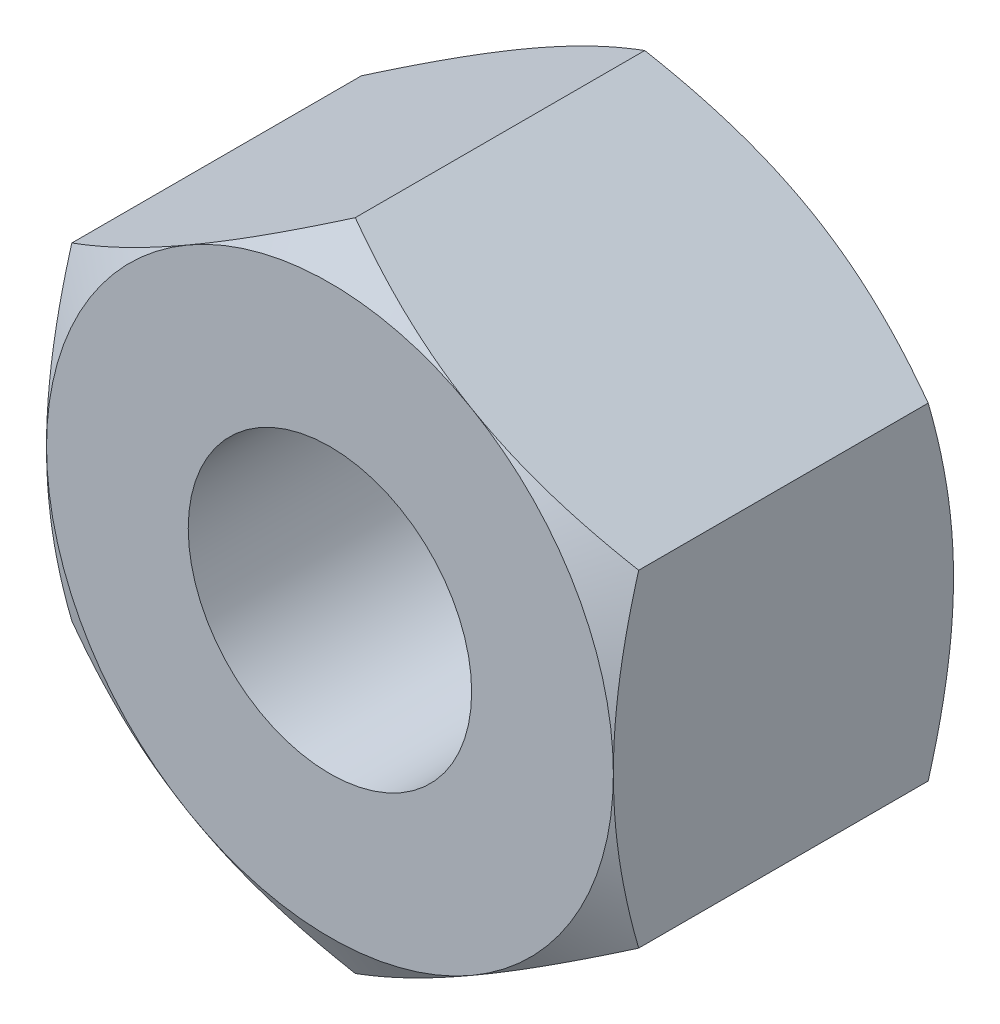
ISO-10303-21;
HEADER;
FILE_DESCRIPTION(('STEP AP214'),'2;1');
FILE_NAME('part.step','',(''),(''),'','','');
FILE_SCHEMA(('AUTOMOTIVE_DESIGN { 1 0 10303 214 1 1 1 1 }'));
ENDSEC;
DATA;
#1=APPLICATION_CONTEXT('core data for automotive mechanical design processes');
#2=APPLICATION_PROTOCOL_DEFINITION('international standard','automotive_design',2000,#1);
#3=PRODUCT_CONTEXT('',#1,'mechanical');
#4=PRODUCT('Part','Part','',(#3));
#5=PRODUCT_RELATED_PRODUCT_CATEGORY('part','',(#4));
#6=PRODUCT_DEFINITION_FORMATION('','',#4);
#7=PRODUCT_DEFINITION_CONTEXT('part definition',#1,'design');
#8=PRODUCT_DEFINITION('design','',#6,#7);
#9=PRODUCT_DEFINITION_SHAPE('','',#8);
#10=(LENGTH_UNIT() NAMED_UNIT(*) SI_UNIT(.MILLI.,.METRE.));
#11=(NAMED_UNIT(*) PLANE_ANGLE_UNIT() SI_UNIT($,.RADIAN.));
#12=(NAMED_UNIT(*) SI_UNIT($,.STERADIAN.) SOLID_ANGLE_UNIT());
#13=UNCERTAINTY_MEASURE_WITH_UNIT(LENGTH_MEASURE(1.E-05),#10,'distance_accuracy_value','');
#14=(GEOMETRIC_REPRESENTATION_CONTEXT(3) GLOBAL_UNCERTAINTY_ASSIGNED_CONTEXT((#13)) GLOBAL_UNIT_ASSIGNED_CONTEXT((#10,
#11,#12)) REPRESENTATION_CONTEXT('',''));
#15=CARTESIAN_POINT('',(0.,0.,0.));
#16=DIRECTION('',(0.,0.,1.));
#17=DIRECTION('',(1.,0.,0.));
#18=AXIS2_PLACEMENT_3D('',#15,#16,#17);
#19=CARTESIAN_POINT('',(0.,0.,6.));
#20=DIRECTION('',(0.,0.,1.));
#21=DIRECTION('',(1.,0.,0.));
#22=AXIS2_PLACEMENT_3D('',#19,#20,#21);
#23=PLANE('',#22);
#24=CARTESIAN_POINT('',(0.,0.,6.));
#25=DIRECTION('',(0.,0.,1.));
#26=DIRECTION('',(1.,0.,0.));
#27=AXIS2_PLACEMENT_3D('',#24,#25,#26);
#28=CIRCLE('',#27,4.99999999999998);
#29=CARTESIAN_POINT('',(5.,0.,6.));
#30=VERTEX_POINT('',#29);
#31=CARTESIAN_POINT('',(2.50000000000001,-4.33012701892219,6.));
#32=VERTEX_POINT('',#31);
#33=EDGE_CURVE('E11',#30,#32,#28,.F.);
#34=ORIENTED_EDGE('',*,*,#33,.F.);
#35=CARTESIAN_POINT('',(2.50000000000001,4.33012701892219,6.));
#36=VERTEX_POINT('',#35);
#37=EDGE_CURVE('E38',#36,#30,#28,.F.);
#38=ORIENTED_EDGE('',*,*,#37,.F.);
#39=CARTESIAN_POINT('',(-2.49999999999999,4.3301270189222,6.));
#40=VERTEX_POINT('',#39);
#41=EDGE_CURVE('E277',#40,#36,#28,.F.);
#42=ORIENTED_EDGE('',*,*,#41,.F.);
#43=CARTESIAN_POINT('',(-5.,0.,6.));
#44=VERTEX_POINT('',#43);
#45=EDGE_CURVE('E281',#44,#40,#28,.F.);
#46=ORIENTED_EDGE('',*,*,#45,.F.);
#47=CARTESIAN_POINT('',(-2.49999999999999,-4.3301270189222,6.));
#48=VERTEX_POINT('',#47);
#49=EDGE_CURVE('E305',#48,#44,#28,.F.);
#50=ORIENTED_EDGE('',*,*,#49,.F.);
#51=EDGE_CURVE('E43',#32,#48,#28,.F.);
#52=ORIENTED_EDGE('',*,*,#51,.F.);
#53=EDGE_LOOP('',(#34,#38,#42,#46,#50,#52));
#54=FACE_BOUND('',#53,.T.);
#55=CARTESIAN_POINT('',(0.,0.,6.));
#56=DIRECTION('',(0.,0.,1.));
#57=DIRECTION('',(1.,0.,0.));
#58=AXIS2_PLACEMENT_3D('',#55,#56,#57);
#59=CIRCLE('',#58,2.5);
#60=CARTESIAN_POINT('',(2.5,0.,6.));
#61=VERTEX_POINT('',#60);
#62=EDGE_CURVE('E248',#61,#61,#59,.T.);
#63=ORIENTED_EDGE('',*,*,#62,.F.);
#64=EDGE_LOOP('',(#63));
#65=FACE_BOUND('',#64,.T.);
#66=ADVANCED_FACE('F33',(#54,#65),#23,.T.);
#67=CARTESIAN_POINT('',(0.,0.,0.));
#68=DIRECTION('',(0.,0.,1.));
#69=DIRECTION('',(1.,0.,0.));
#70=AXIS2_PLACEMENT_3D('',#67,#68,#69);
#71=PLANE('',#70);
#72=CARTESIAN_POINT('',(0.,0.,0.));
#73=DIRECTION('',(0.,0.,1.));
#74=DIRECTION('',(1.,0.,0.));
#75=AXIS2_PLACEMENT_3D('',#72,#73,#74);
#76=CIRCLE('',#75,2.5);
#77=CARTESIAN_POINT('',(2.5,0.,0.));
#78=VERTEX_POINT('',#77);
#79=EDGE_CURVE('E251',#78,#78,#76,.F.);
#80=ORIENTED_EDGE('',*,*,#79,.F.);
#81=EDGE_LOOP('',(#80));
#82=FACE_BOUND('',#81,.T.);
#83=CARTESIAN_POINT('',(0.,0.,0.));
#84=DIRECTION('',(0.,0.,1.));
#85=DIRECTION('',(1.,0.,0.));
#86=AXIS2_PLACEMENT_3D('',#83,#84,#85);
#87=CIRCLE('',#86,4.99999999999999);
#88=CARTESIAN_POINT('',(2.5,4.3301270189222,0.));
#89=VERTEX_POINT('',#88);
#90=CARTESIAN_POINT('',(5.,0.,0.));
#91=VERTEX_POINT('',#90);
#92=EDGE_CURVE('E142',#89,#91,#87,.F.);
#93=ORIENTED_EDGE('',*,*,#92,.T.);
#94=CARTESIAN_POINT('',(2.5,-4.33012701892219,0.));
#95=VERTEX_POINT('',#94);
#96=EDGE_CURVE('E150',#91,#95,#87,.F.);
#97=ORIENTED_EDGE('',*,*,#96,.T.);
#98=CARTESIAN_POINT('',(-2.5,-4.3301270189222,0.));
#99=VERTEX_POINT('',#98);
#100=EDGE_CURVE('E288',#95,#99,#87,.F.);
#101=ORIENTED_EDGE('',*,*,#100,.T.);
#102=CARTESIAN_POINT('',(-5.,0.,0.));
#103=VERTEX_POINT('',#102);
#104=EDGE_CURVE('E291',#99,#103,#87,.F.);
#105=ORIENTED_EDGE('',*,*,#104,.T.);
#106=CARTESIAN_POINT('',(-2.5,4.3301270189222,0.));
#107=VERTEX_POINT('',#106);
#108=EDGE_CURVE('E154',#103,#107,#87,.F.);
#109=ORIENTED_EDGE('',*,*,#108,.T.);
#110=EDGE_CURVE('E128',#107,#89,#87,.F.);
#111=ORIENTED_EDGE('',*,*,#110,.T.);
#112=EDGE_LOOP('',(#93,#97,#101,#105,#109,#111));
#113=FACE_BOUND('',#112,.T.);
#114=ADVANCED_FACE('F151',(#82,#113),#71,.F.);
#115=CARTESIAN_POINT('',(0.,0.,-0.00100000000000013));
#116=DIRECTION('',(0.,0.,1.));
#117=DIRECTION('',(1.,0.,0.));
#118=AXIS2_PLACEMENT_3D('',#115,#116,#117);
#119=CYLINDRICAL_SURFACE('',#118,2.5);
#120=ORIENTED_EDGE('',*,*,#62,.T.);
#121=EDGE_LOOP('',(#120));
#122=FACE_BOUND('',#121,.T.);
#123=ORIENTED_EDGE('',*,*,#79,.T.);
#124=EDGE_LOOP('',(#123));
#125=FACE_BOUND('',#124,.T.);
#126=ADVANCED_FACE('F333',(#122,#125),#119,.F.);
#127=CARTESIAN_POINT('',(0.,0.,2.99999999999999));
#128=DIRECTION('',(0.,0.,1.));
#129=DIRECTION('',(1.,0.,0.));
#130=AXIS2_PLACEMENT_3D('',#127,#128,#129);
#131=CONICAL_SURFACE('',#130,10.1961524227067,1.0471975511966);
#132=CARTESIAN_POINT('',(5.,-7.80316883937987,2.46393222209149));
#133=CARTESIAN_POINT('',(5.,-7.58434008152841,2.35758454985764));
#134=CARTESIAN_POINT('',(5.,-7.36501415769005,2.25224261642255));
#135=CARTESIAN_POINT('',(5.,-6.92510371666718,2.0441350083384));
#136=CARTESIAN_POINT('',(5.,-6.70451901196256,1.94136973051889));
#137=CARTESIAN_POINT('',(5.,-6.26071393844021,1.7384738184123));
#138=CARTESIAN_POINT('',(5.,-6.03748578801693,1.63836014733487));
#139=CARTESIAN_POINT('',(5.,-5.58927072437996,1.44216575416831));
#140=CARTESIAN_POINT('',(5.,-5.36428389349422,1.34608484462149));
#141=CARTESIAN_POINT('',(5.,-4.90480770728734,1.15596309400265));
#142=CARTESIAN_POINT('',(5.,-4.67024799294134,1.0620913774718));
#143=CARTESIAN_POINT('',(5.,-4.19840267359291,0.881334608140105));
#144=CARTESIAN_POINT('',(5.,-3.96111676881602,0.794450332252961));
#145=CARTESIAN_POINT('',(5.,-3.48386980198859,0.629912976700726));
#146=CARTESIAN_POINT('',(5.,-3.24391509638985,0.552241642646051));
#147=CARTESIAN_POINT('',(5.,-2.76056410759437,0.408589844158487));
#148=CARTESIAN_POINT('',(5.,-2.51716891822013,0.342605750459397));
#149=CARTESIAN_POINT('',(5.,-2.028127397285,0.225808102083455));
#150=CARTESIAN_POINT('',(5.,-1.78250104631849,0.174912413783899));
#151=CARTESIAN_POINT('',(5.,-1.28814345079875,0.0911449660364333));
#152=CARTESIAN_POINT('',(5.,-1.0394125275845,0.0582713567773772));
#153=CARTESIAN_POINT('',(5.,-0.543358368598705,0.0135987921851739));
#154=CARTESIAN_POINT('',(5.,-0.296060514309956,0.00152494939433517));
#155=CARTESIAN_POINT('',(5.,0.198679022003401,-0.00125120072037702));
#156=CARTESIAN_POINT('',(5.,0.446120707025886,0.0080469546423193));
#157=CARTESIAN_POINT('',(5.,0.864703740300243,0.0411910660329488));
#158=CARTESIAN_POINT('',(5.,1.03628722721722,0.0597865031114803));
#159=CARTESIAN_POINT('',(5.,1.37822308981919,0.106123235961369));
#160=CARTESIAN_POINT('',(5.,1.54857530116503,0.133865730373892));
#161=CARTESIAN_POINT('',(5.,2.05753955809973,0.229358194565206));
#162=CARTESIAN_POINT('',(5.,2.3938804141877,0.309357082888703));
#163=CARTESIAN_POINT('',(5.,2.89698014317449,0.448420954505136));
#164=CARTESIAN_POINT('',(5.,3.0663359791463,0.498628291817747));
#165=CARTESIAN_POINT('',(5.,3.40340262437593,0.604338982714489));
#166=CARTESIAN_POINT('',(5.,3.57111342157756,0.659842375080534));
#167=CARTESIAN_POINT('',(5.,3.90494322885525,0.775247559189704));
#168=CARTESIAN_POINT('',(5.,4.07106271100704,0.835147997763797));
#169=CARTESIAN_POINT('',(5.,4.40191818306855,0.958634275436366));
#170=CARTESIAN_POINT('',(5.,4.56665419958039,1.02222004348448));
#171=CARTESIAN_POINT('',(5.,4.99446476329977,1.19196983848214));
#172=CARTESIAN_POINT('',(5.,5.25657381683109,1.30056432093056));
#173=CARTESIAN_POINT('',(5.,5.77823779687665,1.52374409151217));
#174=CARTESIAN_POINT('',(5.,6.03779248157002,1.63832994048436));
#175=CARTESIAN_POINT('',(5.,6.55489643575948,1.87212870196661));
#176=CARTESIAN_POINT('',(5.,6.81244508206398,1.991342988501));
#177=CARTESIAN_POINT('',(5.,7.32585971512802,2.23334853220542));
#178=CARTESIAN_POINT('',(5.,7.58172565531362,2.35613988787512));
#179=CARTESIAN_POINT('',(5.,8.09244052517889,2.60471791070782));
#180=CARTESIAN_POINT('',(5.,8.34728752036519,2.73050854466553));
#181=CARTESIAN_POINT('',(5.,8.85585005557578,2.98435886044892));
#182=CARTESIAN_POINT('',(5.,9.10956558421784,3.11241856503665));
#183=CARTESIAN_POINT('',(5.,9.86922079099677,3.49928186996426));
#184=CARTESIAN_POINT('',(5.,10.3737681995536,3.76081835051602));
#185=CARTESIAN_POINT('',(5.,11.330233530429,4.26257697560308));
#186=CARTESIAN_POINT('',(5.,11.7823970110435,4.50233323843819));
#187=CARTESIAN_POINT('',(5.,12.6851700825874,4.98480887341031));
#188=CARTESIAN_POINT('',(5.,13.135779590258,5.22752840124455));
#189=CARTESIAN_POINT('',(5.,14.0344206427673,5.71442862583434));
#190=CARTESIAN_POINT('',(5.,14.4824558558712,5.95860256292541));
#191=CARTESIAN_POINT('',(5.,15.3775525995183,6.44865476665978));
#192=CARTESIAN_POINT('',(5.,15.8246141964279,6.69453291203248));
#193=CARTESIAN_POINT('',(5.,16.2713292734523,6.94103504986347));
#194=B_SPLINE_CURVE_WITH_KNOTS('',3,(#132,#133,#134,#135,#136,#137,#138,#139,#140,#141,#142,
#143,#144,#145,#146,#147,#148,#149,#150,#151,#152,#153,#154,#155,#156,#157,#158,#159,#160,#161,
#162,#163,#164,#165,#166,#167,#168,#169,#170,#171,#172,#173,#174,#175,#176,#177,#178,#179,#180,
#181,#182,#183,#184,#185,#186,#187,#188,#189,#190,#191,#192,#193),.UNSPECIFIED.,.F.,.F.,(4,2,2,
2,2,2,2,2,2,2,2,2,2,2,2,2,2,2,2,2,2,2,2,2,2,2,2,2,2,2,4),(0.,0.729914624496415,1.45994098077917,
2.19385859499905,2.92774205614457,3.68559492267544,4.44353193655166,5.19994116977278,
5.95611510006769,6.7080938568636,7.45999541506101,8.20188143671202,8.94378351974995,
9.46129810648509,9.97888053591174,11.0145815411683,11.5444594716677,12.0743412826513,
12.6040607033286,13.1337699148117,13.9848048836638,14.835919659198,15.687289063013,
16.5386819326889,17.3912712584004,18.2438691416619,19.9487336739832,21.4841095502972,
23.0195664492263,24.5503166417643,26.0809590029062),.UNSPECIFIED.);
#195=CARTESIAN_POINT('',(5.,2.88675134594813,0.446581987385198));
#196=VERTEX_POINT('',#195);
#197=EDGE_CURVE('E145',#91,#196,#194,.T.);
#198=ORIENTED_EDGE('',*,*,#197,.F.);
#199=ORIENTED_EDGE('',*,*,#92,.F.);
#200=CARTESIAN_POINT('',(5.0002,2.88663587589429,0.446648656051826));
#201=CARTESIAN_POINT('',(4.78046540547481,3.01349970319368,0.373386567637633));
#202=CARTESIAN_POINT('',(4.55885141554042,3.14144859993849,0.306751321918091));
#203=CARTESIAN_POINT('',(4.11178600454648,3.39956193532121,0.190438991010811));
#204=CARTESIAN_POINT('',(3.88632664040922,3.52973095989718,0.14080304991579));
#205=CARTESIAN_POINT('',(3.43816769477649,3.78847564779798,0.0635510254187004));
#206=CARTESIAN_POINT('',(3.21553790689581,3.91701101576052,0.035420378283492));
#207=CARTESIAN_POINT('',(2.88081009815336,4.11026620624323,0.0101949219536879));
#208=CARTESIAN_POINT('',(2.76915780319494,4.17472868879311,0.00461345976948772));
#209=CARTESIAN_POINT('',(2.5457500293262,4.30371322717528,-0.000797783248525579));
#210=CARTESIAN_POINT('',(2.43399455370968,4.36823528110589,-0.000627741741792326));
#211=CARTESIAN_POINT('',(2.12781576914936,4.54500768479195,0.00775363179204104));
#212=CARTESIAN_POINT('',(1.93349391403278,4.65719946015293,0.0218297718972561));
#213=CARTESIAN_POINT('',(1.54613989800229,4.88083840557982,0.066465257109435));
#214=CARTESIAN_POINT('',(1.35310909862843,4.99228478956021,0.0970398601475118));
#215=CARTESIAN_POINT('',(0.964974657525145,5.21637431361295,0.173468493621167));
#216=CARTESIAN_POINT('',(0.769920001358264,5.32898917185759,0.219646378878682));
#217=CARTESIAN_POINT('',(0.382719654641232,5.55253939626498,0.324451794491935));
#218=CARTESIAN_POINT('',(0.190569004591914,5.66347762579592,0.383054703437375));
#219=CARTESIAN_POINT('',(-0.000199999999998646,5.7736181619501,0.446648656051828));
#220=B_SPLINE_CURVE_WITH_KNOTS('',3,(#200,#201,#202,#203,#204,#205,#206,#207,#208,#209,#210,
#211,#212,#213,#214,#215,#216,#217,#218,#219),.UNSPECIFIED.,.F.,.F.,(4,2,2,2,2,2,2,2,2,4),(0.,
0.792555841363091,1.58701660053333,2.3618153748728,2.74884076077325,3.13585419177295,
3.80962362599679,4.48401723901189,5.17336882348928,5.86136694793725),.UNSPECIFIED.);
#221=EDGE_CURVE('E138',#196,#89,#220,.T.);
#222=ORIENTED_EDGE('',*,*,#221,.F.);
#223=EDGE_LOOP('',(#198,#199,#222));
#224=FACE_BOUND('',#223,.T.);
#225=ADVANCED_FACE('F143',(#224),#131,.T.);
#226=CARTESIAN_POINT('',(0.,5.77350269189626,0.446581987385202));
#227=VERTEX_POINT('',#226);
#228=EDGE_CURVE('E124',#89,#227,#220,.T.);
#229=ORIENTED_EDGE('',*,*,#228,.F.);
#230=ORIENTED_EDGE('',*,*,#110,.F.);
#231=CARTESIAN_POINT('',(0.000200000000001142,5.7736181619501,0.446648656051828));
#232=CARTESIAN_POINT('',(-0.219534594525185,5.64675433465071,0.373386567637636));
#233=CARTESIAN_POINT('',(-0.44114858445958,5.5188054379059,0.306751321918094));
#234=CARTESIAN_POINT('',(-0.888213995453512,5.26069210252318,0.190438991010814));
#235=CARTESIAN_POINT('',(-1.11367335959077,5.13052307794721,0.140803049915792));
#236=CARTESIAN_POINT('',(-1.56183230522351,4.87177839004641,0.0635510254187019));
#237=CARTESIAN_POINT('',(-1.78446209310419,4.74324302208387,0.0354203782834941));
#238=CARTESIAN_POINT('',(-2.11918990184664,4.54998783160116,0.0101949219536896));
#239=CARTESIAN_POINT('',(-2.23084219680506,4.48552534905128,0.00461345976948902));
#240=CARTESIAN_POINT('',(-2.4542499706738,4.35654081066911,-0.000797783248524867));
#241=CARTESIAN_POINT('',(-2.56600544629031,4.2920187567385,-0.000627741741791831));
#242=CARTESIAN_POINT('',(-2.87218423085064,4.11524635305245,0.00775363179204129));
#243=CARTESIAN_POINT('',(-3.06650608596721,4.00305457769146,0.0218297718972567));
#244=CARTESIAN_POINT('',(-3.45386010199771,3.77941563226458,0.0664652571094356));
#245=CARTESIAN_POINT('',(-3.64689090137157,3.66796924828419,0.0970398601475121));
#246=CARTESIAN_POINT('',(-4.03502534247485,3.44387972423144,0.173468493621167));
#247=CARTESIAN_POINT('',(-4.23007999864174,3.3312648659868,0.219646378878684));
#248=CARTESIAN_POINT('',(-4.61728034535877,3.10771464157941,0.324451794491938));
#249=CARTESIAN_POINT('',(-4.80943099540809,2.99677641204847,0.383054703437377));
#250=CARTESIAN_POINT('',(-5.0002,2.88663587589429,0.446648656051831));
#251=B_SPLINE_CURVE_WITH_KNOTS('',3,(#231,#232,#233,#234,#235,#236,#237,#238,#239,#240,#241,
#242,#243,#244,#245,#246,#247,#248,#249,#250),.UNSPECIFIED.,.F.,.F.,(4,2,2,2,2,2,2,2,2,4),(0.,
0.79255584136309,1.58701660053333,2.3618153748728,2.74884076077325,3.13585419177295,
3.80962362599679,4.48401723901189,5.17336882348929,5.86136694793725),.UNSPECIFIED.);
#252=EDGE_CURVE('E131',#227,#107,#251,.T.);
#253=ORIENTED_EDGE('',*,*,#252,.F.);
#254=EDGE_LOOP('',(#229,#230,#253));
#255=FACE_BOUND('',#254,.T.);
#256=ADVANCED_FACE('F126',(#255),#131,.T.);
#257=CARTESIAN_POINT('',(-5.,2.88675134594813,0.446581987385204));
#258=VERTEX_POINT('',#257);
#259=EDGE_CURVE('E204',#107,#258,#251,.T.);
#260=ORIENTED_EDGE('',*,*,#259,.F.);
#261=ORIENTED_EDGE('',*,*,#108,.F.);
#262=CARTESIAN_POINT('',(-5.,-7.80316883937986,2.4639322220915));
#263=CARTESIAN_POINT('',(-5.,-7.5843400815284,2.35758454985765));
#264=CARTESIAN_POINT('',(-5.,-7.36501415769004,2.25224261642256));
#265=CARTESIAN_POINT('',(-5.,-6.92510371666717,2.0441350083384));
#266=CARTESIAN_POINT('',(-5.,-6.70451901196255,1.9413697305189));
#267=CARTESIAN_POINT('',(-5.,-6.2607139384402,1.7384738184123));
#268=CARTESIAN_POINT('',(-5.,-6.03748578801692,1.63836014733488));
#269=CARTESIAN_POINT('',(-5.,-5.58927072437995,1.44216575416831));
#270=CARTESIAN_POINT('',(-5.,-5.36428389349421,1.34608484462149));
#271=CARTESIAN_POINT('',(-5.,-4.90480770728733,1.15596309400266));
#272=CARTESIAN_POINT('',(-5.,-4.67024799294133,1.0620913774718));
#273=CARTESIAN_POINT('',(-5.,-4.1984026735929,0.88133460814011));
#274=CARTESIAN_POINT('',(-5.,-3.96111676881601,0.794450332252966));
#275=CARTESIAN_POINT('',(-5.,-3.48386980198859,0.62991297670073));
#276=CARTESIAN_POINT('',(-5.,-3.24391509638984,0.552241642646055));
#277=CARTESIAN_POINT('',(-5.,-2.76056410759437,0.408589844158491));
#278=CARTESIAN_POINT('',(-5.,-2.51716891822013,0.342605750459402));
#279=CARTESIAN_POINT('',(-5.,-2.028127397285,0.22580810208346));
#280=CARTESIAN_POINT('',(-5.,-1.78250104631849,0.174912413783904));
#281=CARTESIAN_POINT('',(-5.,-1.28814345079875,0.0911449660364373));
#282=CARTESIAN_POINT('',(-5.,-1.0394125275845,0.0582713567773808));
#283=CARTESIAN_POINT('',(-5.,-0.543358368598703,0.0135987921851773));
#284=CARTESIAN_POINT('',(-5.,-0.296060514309954,0.001524949394339));
#285=CARTESIAN_POINT('',(-5.,0.198679022003402,-0.00125120072037294));
#286=CARTESIAN_POINT('',(-5.,0.446120707025886,0.00804695464232313));
#287=CARTESIAN_POINT('',(-5.,0.864703740300241,0.0411910660329522));
#288=CARTESIAN_POINT('',(-5.,1.03628722721722,0.0597865031114836));
#289=CARTESIAN_POINT('',(-5.,1.37822308981919,0.106123235961373));
#290=CARTESIAN_POINT('',(-5.,1.54857530116502,0.133865730373896));
#291=CARTESIAN_POINT('',(-5.,2.05753955809972,0.22935819456521));
#292=CARTESIAN_POINT('',(-5.,2.39388041418769,0.309357082888705));
#293=CARTESIAN_POINT('',(-5.,2.89698014317448,0.448420954505138));
#294=CARTESIAN_POINT('',(-5.,3.06633597914629,0.49862829181775));
#295=CARTESIAN_POINT('',(-5.,3.40340262437592,0.604338982714491));
#296=CARTESIAN_POINT('',(-5.,3.57111342157755,0.659842375080536));
#297=CARTESIAN_POINT('',(-5.,3.90494322885524,0.775247559189705));
#298=CARTESIAN_POINT('',(-5.,4.07106271100703,0.835147997763798));
#299=CARTESIAN_POINT('',(-5.,4.40191818306854,0.958634275436366));
#300=CARTESIAN_POINT('',(-5.,4.56665419958037,1.02222004348448));
#301=CARTESIAN_POINT('',(-5.,4.99446476329976,1.19196983848214));
#302=CARTESIAN_POINT('',(-5.,5.25657381683108,1.30056432093056));
#303=CARTESIAN_POINT('',(-5.,5.77823779687664,1.52374409151217));
#304=CARTESIAN_POINT('',(-5.,6.03779248157001,1.63832994048436));
#305=CARTESIAN_POINT('',(-5.,6.55489643575947,1.87212870196661));
#306=CARTESIAN_POINT('',(-5.,6.81244508206396,1.991342988501));
#307=CARTESIAN_POINT('',(-5.,7.325859715128,2.23334853220542));
#308=CARTESIAN_POINT('',(-5.,7.5817256553136,2.35613988787512));
#309=CARTESIAN_POINT('',(-5.,8.09244052517887,2.60471791070782));
#310=CARTESIAN_POINT('',(-5.,8.34728752036517,2.73050854466553));
#311=CARTESIAN_POINT('',(-5.,8.85585005557576,2.98435886044891));
#312=CARTESIAN_POINT('',(-5.,9.10956558421782,3.11241856503665));
#313=CARTESIAN_POINT('',(-5.,9.86922079099675,3.49928186996426));
#314=CARTESIAN_POINT('',(-5.,10.3737681995535,3.76081835051602));
#315=CARTESIAN_POINT('',(-5.,11.330233530429,4.26257697560308));
#316=CARTESIAN_POINT('',(-5.,11.7823970110435,4.50233323843818));
#317=CARTESIAN_POINT('',(-5.,12.6851700825873,4.9848088734103));
#318=CARTESIAN_POINT('',(-5.,13.135779590258,5.22752840124454));
#319=CARTESIAN_POINT('',(-5.,14.0344206427673,5.71442862583433));
#320=CARTESIAN_POINT('',(-5.,14.4824558558711,5.95860256292541));
#321=CARTESIAN_POINT('',(-5.,15.3775525995183,6.44865476665978));
#322=CARTESIAN_POINT('',(-5.,15.8246141964279,6.69453291203247));
#323=CARTESIAN_POINT('',(-5.,16.2713292734523,6.94103504986347));
#324=B_SPLINE_CURVE_WITH_KNOTS('',3,(#262,#263,#264,#265,#266,#267,#268,#269,#270,#271,#272,
#273,#274,#275,#276,#277,#278,#279,#280,#281,#282,#283,#284,#285,#286,#287,#288,#289,#290,#291,
#292,#293,#294,#295,#296,#297,#298,#299,#300,#301,#302,#303,#304,#305,#306,#307,#308,#309,#310,
#311,#312,#313,#314,#315,#316,#317,#318,#319,#320,#321,#322,#323),.UNSPECIFIED.,.F.,.F.,(4,2,2,
2,2,2,2,2,2,2,2,2,2,2,2,2,2,2,2,2,2,2,2,2,2,2,2,2,2,2,4),(0.,0.729914624496413,1.45994098077916,
2.19385859499905,2.92774205614456,3.68559492267544,4.44353193655165,5.19994116977277,
5.95611510006768,6.70809385686359,7.45999541506099,8.20188143671201,8.94378351974994,
9.46129810648507,9.97888053591171,11.0145815411682,11.5444594716677,12.0743412826513,
12.6040607033286,13.1337699148116,13.9848048836637,14.835919659198,15.6872890630129,
16.5386819326888,17.3912712584003,18.2438691416619,19.9487336739831,21.4841095502972,
23.0195664492263,24.5503166417642,26.0809590029062),.UNSPECIFIED.);
#325=EDGE_CURVE('E197',#258,#103,#324,.F.);
#326=ORIENTED_EDGE('',*,*,#325,.F.);
#327=EDGE_LOOP('',(#260,#261,#326));
#328=FACE_BOUND('',#327,.T.);
#329=ADVANCED_FACE('F300',(#328),#131,.T.);
#330=CARTESIAN_POINT('',(-5.,-2.88675134594862,0.446581987384879));
#331=VERTEX_POINT('',#330);
#332=EDGE_CURVE('E203',#103,#331,#324,.F.);
#333=ORIENTED_EDGE('',*,*,#332,.F.);
#334=ORIENTED_EDGE('',*,*,#104,.F.);
#335=CARTESIAN_POINT('',(-5.0002,-2.88663587589429,0.44664865605183));
#336=CARTESIAN_POINT('',(-4.78046540547482,-3.01349970319368,0.373386567637636));
#337=CARTESIAN_POINT('',(-4.55885141554042,-3.14144859993849,0.306751321918094));
#338=CARTESIAN_POINT('',(-4.11178600454649,-3.39956193532121,0.190438991010815));
#339=CARTESIAN_POINT('',(-3.88632664040923,-3.52973095989718,0.140803049915793));
#340=CARTESIAN_POINT('',(-3.43816769477649,-3.78847564779797,0.0635510254187026));
#341=CARTESIAN_POINT('',(-3.21553790689581,-3.91701101576052,0.0354203782834937));
#342=CARTESIAN_POINT('',(-2.88081009815336,-4.11026620624322,0.010194921953689));
#343=CARTESIAN_POINT('',(-2.76915780319494,-4.17472868879311,0.00461345976948867));
#344=CARTESIAN_POINT('',(-2.54575002932621,-4.30371322717528,-0.000797783248525199));
#345=CARTESIAN_POINT('',(-2.43399455370969,-4.36823528110588,-0.000627741741792343));
#346=CARTESIAN_POINT('',(-2.12781576914937,-4.54500768479194,0.00775363179203992));
#347=CARTESIAN_POINT('',(-1.93349391403279,-4.65719946015292,0.0218297718972544));
#348=CARTESIAN_POINT('',(-1.5461398980023,-4.88083840557981,0.0664652571094335));
#349=CARTESIAN_POINT('',(-1.35310909862843,-4.9922847895602,0.0970398601475111));
#350=CARTESIAN_POINT('',(-0.964974657525149,-5.21637431361295,0.173468493621166));
#351=CARTESIAN_POINT('',(-0.769920001358267,-5.32898917185759,0.219646378878682));
#352=CARTESIAN_POINT('',(-0.382719654641233,-5.55253939626498,0.324451794491934));
#353=CARTESIAN_POINT('',(-0.190569004591915,-5.66347762579592,0.383054703437373));
#354=CARTESIAN_POINT('',(0.000199999999998194,-5.7736181619501,0.446648656051828));
#355=B_SPLINE_CURVE_WITH_KNOTS('',3,(#335,#336,#337,#338,#339,#340,#341,#342,#343,#344,#345,
#346,#347,#348,#349,#350,#351,#352,#353,#354),.UNSPECIFIED.,.F.,.F.,(4,2,2,2,2,2,2,2,2,4),(0.,
0.792555841363089,1.58701660053333,2.3618153748728,2.74884076077325,3.13585419177294,
3.80962362599679,4.48401723901189,5.17336882348928,5.86136694793725),.UNSPECIFIED.);
#356=EDGE_CURVE('E205',#331,#99,#355,.T.);
#357=ORIENTED_EDGE('',*,*,#356,.F.);
#358=EDGE_LOOP('',(#333,#334,#357));
#359=FACE_BOUND('',#358,.T.);
#360=ADVANCED_FACE('F182',(#359),#131,.T.);
#361=CARTESIAN_POINT('',(0.,-5.77350269189626,0.446581987385201));
#362=VERTEX_POINT('',#361);
#363=EDGE_CURVE('E353',#99,#362,#355,.T.);
#364=ORIENTED_EDGE('',*,*,#363,.F.);
#365=ORIENTED_EDGE('',*,*,#100,.F.);
#366=CARTESIAN_POINT('',(-0.000200000000001159,-5.7736181619501,0.446648656051828));
#367=CARTESIAN_POINT('',(0.219534594525184,-5.64675433465071,0.373386567637634));
#368=CARTESIAN_POINT('',(0.441148584459579,-5.5188054379059,0.306751321918092));
#369=CARTESIAN_POINT('',(0.888213995453511,-5.26069210252318,0.190438991010812));
#370=CARTESIAN_POINT('',(1.11367335959077,-5.13052307794721,0.140803049915791));
#371=CARTESIAN_POINT('',(1.56183230522351,-4.87177839004641,0.0635510254187003));
#372=CARTESIAN_POINT('',(1.78446209310419,-4.74324302208387,0.0354203782834917));
#373=CARTESIAN_POINT('',(2.11918990184664,-4.54998783160117,0.0101949219536873));
#374=CARTESIAN_POINT('',(2.23084219680506,-4.48552534905128,0.004613459769487));
#375=CARTESIAN_POINT('',(2.45424997067379,-4.35654081066911,-0.000797783248526842));
#376=CARTESIAN_POINT('',(2.56600544629031,-4.2920187567385,-0.000627741741794022));
#377=CARTESIAN_POINT('',(2.87218423085064,-4.11524635305245,0.00775363179203856));
#378=CARTESIAN_POINT('',(3.06650608596721,-4.00305457769146,0.0218297718972536));
#379=CARTESIAN_POINT('',(3.4538601019977,-3.77941563226458,0.0664652571094325));
#380=CARTESIAN_POINT('',(3.64689090137157,-3.66796924828419,0.0970398601475094));
#381=CARTESIAN_POINT('',(4.03502534247485,-3.44387972423144,0.173468493621164));
#382=CARTESIAN_POINT('',(4.23007999864173,-3.3312648659868,0.219646378878679));
#383=CARTESIAN_POINT('',(4.61728034535876,-3.10771464157941,0.324451794491932));
#384=CARTESIAN_POINT('',(4.80943099540808,-2.99677641204847,0.383054703437371));
#385=CARTESIAN_POINT('',(5.0002,-2.88663587589429,0.446648656051825));
#386=B_SPLINE_CURVE_WITH_KNOTS('',3,(#366,#367,#368,#369,#370,#371,#372,#373,#374,#375,#376,
#377,#378,#379,#380,#381,#382,#383,#384,#385),.UNSPECIFIED.,.F.,.F.,(4,2,2,2,2,2,2,2,2,4),(0.,
0.79255584136309,1.58701660053333,2.3618153748728,2.74884076077325,3.13585419177295,
3.80962362599679,4.48401723901189,5.17336882348928,5.86136694793725),.UNSPECIFIED.);
#387=EDGE_CURVE('E163',#362,#95,#386,.T.);
#388=ORIENTED_EDGE('',*,*,#387,.F.);
#389=EDGE_LOOP('',(#364,#365,#388));
#390=FACE_BOUND('',#389,.T.);
#391=ADVANCED_FACE('F177',(#390),#131,.T.);
#392=CARTESIAN_POINT('',(5.,-2.88675134594813,0.446581987385198));
#393=VERTEX_POINT('',#392);
#394=EDGE_CURVE('E159',#95,#393,#386,.T.);
#395=ORIENTED_EDGE('',*,*,#394,.F.);
#396=ORIENTED_EDGE('',*,*,#96,.F.);
#397=EDGE_CURVE('E136',#393,#91,#194,.T.);
#398=ORIENTED_EDGE('',*,*,#397,.F.);
#399=EDGE_LOOP('',(#395,#396,#398));
#400=FACE_BOUND('',#399,.T.);
#401=ADVANCED_FACE('F181',(#400),#131,.T.);
#402=CARTESIAN_POINT('',(0.,0.,7.));
#403=DIRECTION('',(0.,0.,-1.));
#404=DIRECTION('',(-1.,0.,0.));
#405=AXIS2_PLACEMENT_3D('',#402,#403,#404);
#406=CONICAL_SURFACE('',#405,3.26794919243109,1.0471975511966);
#407=CARTESIAN_POINT('',(-0.000199999999999366,5.7736181619501,5.55335134394816));
#408=CARTESIAN_POINT('',(0.219534594525185,5.64675433465071,5.62661343236236));
#409=CARTESIAN_POINT('',(0.441148584459581,5.5188054379059,5.6932486780819));
#410=CARTESIAN_POINT('',(0.888213995453514,5.26069210252318,5.80956100898918));
#411=CARTESIAN_POINT('',(1.11367335959078,5.13052307794721,5.8591969500842));
#412=CARTESIAN_POINT('',(1.56183230522351,4.87177839004641,5.93644897458129));
#413=CARTESIAN_POINT('',(1.78446209310419,4.74324302208387,5.9645796217165));
#414=CARTESIAN_POINT('',(2.11918990184664,4.54998783160116,5.9898050780463));
#415=CARTESIAN_POINT('',(2.23084219680506,4.48552534905128,5.9953865402305));
#416=CARTESIAN_POINT('',(2.4542499706738,4.35654081066911,6.00079778324852));
#417=CARTESIAN_POINT('',(2.56600544629032,4.2920187567385,6.00062774174178));
#418=CARTESIAN_POINT('',(2.87218423085064,4.11524635305244,5.99224636820795));
#419=CARTESIAN_POINT('',(3.06650608596721,4.00305457769146,5.97817022810273));
#420=CARTESIAN_POINT('',(3.45386010199771,3.77941563226458,5.93353474289055));
#421=CARTESIAN_POINT('',(3.64689090137157,3.66796924828419,5.90296013985248));
#422=CARTESIAN_POINT('',(4.03502534247485,3.44387972423144,5.82653150637882));
#423=CARTESIAN_POINT('',(4.23007999864174,3.3312648659868,5.7803536211213));
#424=CARTESIAN_POINT('',(4.61728034535877,3.10771464157941,5.67554820550805));
#425=CARTESIAN_POINT('',(4.80943099540809,2.99677641204847,5.61694529656261));
#426=CARTESIAN_POINT('',(5.0002,2.88663587589429,5.55335134394816));
#427=B_SPLINE_CURVE_WITH_KNOTS('',3,(#407,#408,#409,#410,#411,#412,#413,#414,#415,#416,#417,
#418,#419,#420,#421,#422,#423,#424,#425,#426),.UNSPECIFIED.,.F.,.F.,(4,2,2,2,2,2,2,2,2,4),(0.,
0.792555841363091,1.58701660053333,2.3618153748728,2.74884076077325,3.13585419177295,
3.80962362599679,4.48401723901189,5.17336882348929,5.86136694793725),.UNSPECIFIED.);
#428=CARTESIAN_POINT('',(5.,2.88675134594813,5.55341801261478));
#429=VERTEX_POINT('',#428);
#430=EDGE_CURVE('E247',#36,#429,#427,.T.);
#431=ORIENTED_EDGE('',*,*,#430,.F.);
#432=ORIENTED_EDGE('',*,*,#37,.T.);
#433=CARTESIAN_POINT('',(5.,-7.80316883937986,3.53606777790848));
#434=CARTESIAN_POINT('',(5.,-7.5843400815284,3.64241545014233));
#435=CARTESIAN_POINT('',(5.,-7.36501415769004,3.74775738357742));
#436=CARTESIAN_POINT('',(5.,-6.92510371666717,3.95586499166158));
#437=CARTESIAN_POINT('',(5.,-6.70451901196255,4.05863026948109));
#438=CARTESIAN_POINT('',(5.,-6.2607139384402,4.26152618158768));
#439=CARTESIAN_POINT('',(5.,-6.03748578801692,4.36163985266511));
#440=CARTESIAN_POINT('',(5.,-5.58927072437995,4.55783424583167));
#441=CARTESIAN_POINT('',(5.,-5.36428389349422,4.65391515537849));
#442=CARTESIAN_POINT('',(5.,-4.90480770728733,4.84403690599733));
#443=CARTESIAN_POINT('',(5.,-4.67024799294134,4.93790862252818));
#444=CARTESIAN_POINT('',(5.,-4.1984026735929,5.11866539185988));
#445=CARTESIAN_POINT('',(5.,-3.96111676881602,5.20554966774702));
#446=CARTESIAN_POINT('',(5.,-3.48386980198859,5.37008702329926));
#447=CARTESIAN_POINT('',(5.,-3.24391509638985,5.44775835735393));
#448=CARTESIAN_POINT('',(5.,-2.76056410759437,5.5914101558415));
#449=CARTESIAN_POINT('',(5.,-2.51716891822013,5.65739424954059));
#450=CARTESIAN_POINT('',(5.,-2.028127397285,5.77419189791653));
#451=CARTESIAN_POINT('',(5.,-1.78250104631849,5.82508758621609));
#452=CARTESIAN_POINT('',(5.,-1.28814345079875,5.90885503396355));
#453=CARTESIAN_POINT('',(5.,-1.03941252758449,5.94172864322261));
#454=CARTESIAN_POINT('',(5.,-0.543358368598702,5.98640120781481));
#455=CARTESIAN_POINT('',(5.,-0.296060514309953,5.99847505060565));
#456=CARTESIAN_POINT('',(5.,0.198679022003403,6.00125120072036));
#457=CARTESIAN_POINT('',(5.,0.446120707025888,5.99195304535767));
#458=CARTESIAN_POINT('',(5.,0.864703740300242,5.95880893396704));
#459=CARTESIAN_POINT('',(5.,1.03628722721722,5.94021349688851));
#460=CARTESIAN_POINT('',(5.,1.37822308981919,5.89387676403862));
#461=CARTESIAN_POINT('',(5.,1.54857530116502,5.8661342696261));
#462=CARTESIAN_POINT('',(5.,2.05753955809972,5.77064180543478));
#463=CARTESIAN_POINT('',(5.,2.39388041418769,5.69064291711128));
#464=CARTESIAN_POINT('',(5.,2.89698014317448,5.55157904549485));
#465=CARTESIAN_POINT('',(5.,3.06633597914628,5.50137170818224));
#466=CARTESIAN_POINT('',(5.,3.40340262437591,5.3956610172855));
#467=CARTESIAN_POINT('',(5.,3.57111342157754,5.34015762491945));
#468=CARTESIAN_POINT('',(5.,3.90494322885523,5.22475244081028));
#469=CARTESIAN_POINT('',(5.,4.07106271100702,5.16485200223619));
#470=CARTESIAN_POINT('',(5.,4.40191818306853,5.04136572456362));
#471=CARTESIAN_POINT('',(5.,4.56665419958036,4.97777995651551));
#472=CARTESIAN_POINT('',(5.,4.99446476329975,4.80803016151785));
#473=CARTESIAN_POINT('',(5.,5.25657381683107,4.69943567906943));
#474=CARTESIAN_POINT('',(5.,5.77823779687663,4.47625590848782));
#475=CARTESIAN_POINT('',(5.,6.03779248157,4.36167005951563));
#476=CARTESIAN_POINT('',(5.,6.55489643575946,4.12787129803337));
#477=CARTESIAN_POINT('',(5.,6.81244508206395,4.00865701149899));
#478=CARTESIAN_POINT('',(5.,7.32585971512799,3.76665146779456));
#479=CARTESIAN_POINT('',(5.,7.58172565531359,3.64386011212487));
#480=CARTESIAN_POINT('',(5.,8.09244052517887,3.39528208929216));
#481=CARTESIAN_POINT('',(5.,8.34728752036516,3.26949145533445));
#482=CARTESIAN_POINT('',(5.,8.85585005557576,3.01564113955106));
#483=CARTESIAN_POINT('',(5.,9.10956558421782,2.88758143496333));
#484=CARTESIAN_POINT('',(5.,9.86922079099675,2.50071813003572));
#485=CARTESIAN_POINT('',(5.,10.3737681995535,2.23918164948395));
#486=CARTESIAN_POINT('',(5.,11.330233530429,1.73742302439689));
#487=CARTESIAN_POINT('',(5.,11.7823970110435,1.49766676156179));
#488=CARTESIAN_POINT('',(5.,12.6851700825873,1.01519112658967));
#489=CARTESIAN_POINT('',(5.,13.135779590258,0.772471598755425));
#490=CARTESIAN_POINT('',(5.,14.0344206427673,0.285571374165634));
#491=CARTESIAN_POINT('',(5.,14.4824558558711,0.0413974370745584));
#492=CARTESIAN_POINT('',(5.,15.3775525995183,-0.448654766659809));
#493=CARTESIAN_POINT('',(5.,15.8246141964279,-0.694532912032507));
#494=CARTESIAN_POINT('',(5.,16.2713292734523,-0.941035049863504));
#495=B_SPLINE_CURVE_WITH_KNOTS('',3,(#433,#434,#435,#436,#437,#438,#439,#440,#441,#442,#443,
#444,#445,#446,#447,#448,#449,#450,#451,#452,#453,#454,#455,#456,#457,#458,#459,#460,#461,#462,
#463,#464,#465,#466,#467,#468,#469,#470,#471,#472,#473,#474,#475,#476,#477,#478,#479,#480,#481,
#482,#483,#484,#485,#486,#487,#488,#489,#490,#491,#492,#493,#494),.UNSPECIFIED.,.F.,.F.,(4,2,2,
2,2,2,2,2,2,2,2,2,2,2,2,2,2,2,2,2,2,2,2,2,2,2,2,2,2,2,4),(0.,0.729914624496414,1.45994098077916,
2.19385859499905,2.92774205614457,3.68559492267544,4.44353193655166,5.19994116977278,
5.95611510006769,6.7080938568636,7.459995415061,8.20188143671201,8.94378351974995,
9.46129810648508,9.97888053591172,11.0145815411682,11.5444594716677,12.0743412826513,
12.6040607033286,13.1337699148116,13.9848048836637,14.835919659198,15.687289063013,
16.5386819326888,17.3912712584003,18.2438691416619,19.9487336739831,21.4841095502972,
23.0195664492263,24.5503166417642,26.0809590029062),.UNSPECIFIED.);
#496=EDGE_CURVE('E252',#429,#30,#495,.F.);
#497=ORIENTED_EDGE('',*,*,#496,.F.);
#498=EDGE_LOOP('',(#431,#432,#497));
#499=FACE_BOUND('',#498,.T.);
#500=ADVANCED_FACE('F184',(#499),#406,.T.);
#501=CARTESIAN_POINT('',(-5.0002,2.88663587589429,5.55335134394817));
#502=CARTESIAN_POINT('',(-4.78046540547482,3.01349970319368,5.62661343236236));
#503=CARTESIAN_POINT('',(-4.55885141554042,3.14144859993849,5.6932486780819));
#504=CARTESIAN_POINT('',(-4.11178600454649,3.39956193532121,5.80956100898918));
#505=CARTESIAN_POINT('',(-3.88632664040923,3.52973095989718,5.8591969500842));
#506=CARTESIAN_POINT('',(-3.43816769477649,3.78847564779798,5.93644897458129));
#507=CARTESIAN_POINT('',(-3.21553790689581,3.91701101576052,5.9645796217165));
#508=CARTESIAN_POINT('',(-2.88081009815336,4.11026620624323,5.98980507804631));
#509=CARTESIAN_POINT('',(-2.76915780319494,4.17472868879311,5.99538654023051));
#510=CARTESIAN_POINT('',(-2.5457500293262,4.30371322717528,6.00079778324852));
#511=CARTESIAN_POINT('',(-2.43399455370969,4.36823528110589,6.00062774174179));
#512=CARTESIAN_POINT('',(-2.12781576914936,4.54500768479195,5.99224636820795));
#513=CARTESIAN_POINT('',(-1.93349391403279,4.65719946015293,5.97817022810274));
#514=CARTESIAN_POINT('',(-1.54613989800229,4.88083840557981,5.93353474289056));
#515=CARTESIAN_POINT('',(-1.35310909862843,4.9922847895602,5.90296013985248));
#516=CARTESIAN_POINT('',(-0.964974657525145,5.21637431361295,5.82653150637883));
#517=CARTESIAN_POINT('',(-0.769920001358263,5.32898917185759,5.78035362112131));
#518=CARTESIAN_POINT('',(-0.38271965464123,5.55253939626498,5.67554820550806));
#519=CARTESIAN_POINT('',(-0.190569004591912,5.66347762579592,5.61694529656262));
#520=CARTESIAN_POINT('',(0.000200000000001013,5.7736181619501,5.55335134394816));
#521=B_SPLINE_CURVE_WITH_KNOTS('',3,(#501,#502,#503,#504,#505,#506,#507,#508,#509,#510,#511,
#512,#513,#514,#515,#516,#517,#518,#519,#520),.UNSPECIFIED.,.F.,.F.,(4,2,2,2,2,2,2,2,2,4),(0.,
0.792555841363091,1.58701660053333,2.3618153748728,2.74884076077325,3.13585419177295,
3.80962362599679,4.48401723901189,5.17336882348929,5.86136694793725),.UNSPECIFIED.);
#522=CARTESIAN_POINT('',(0.,5.77350269189626,5.55341801261479));
#523=VERTEX_POINT('',#522);
#524=EDGE_CURVE('E240',#40,#523,#521,.T.);
#525=ORIENTED_EDGE('',*,*,#524,.F.);
#526=ORIENTED_EDGE('',*,*,#41,.T.);
#527=EDGE_CURVE('E241',#523,#36,#427,.T.);
#528=ORIENTED_EDGE('',*,*,#527,.F.);
#529=EDGE_LOOP('',(#525,#526,#528));
#530=FACE_BOUND('',#529,.T.);
#531=ADVANCED_FACE('F274',(#530),#406,.T.);
#532=CARTESIAN_POINT('',(-5.,-7.80316883937986,3.53606777790849));
#533=CARTESIAN_POINT('',(-5.,-7.5843400815284,3.64241545014234));
#534=CARTESIAN_POINT('',(-5.,-7.36501415769004,3.74775738357743));
#535=CARTESIAN_POINT('',(-5.,-6.92510371666717,3.95586499166159));
#536=CARTESIAN_POINT('',(-5.,-6.70451901196255,4.0586302694811));
#537=CARTESIAN_POINT('',(-5.,-6.2607139384402,4.26152618158769));
#538=CARTESIAN_POINT('',(-5.,-6.03748578801692,4.36163985266512));
#539=CARTESIAN_POINT('',(-5.,-5.58927072437995,4.55783424583168));
#540=CARTESIAN_POINT('',(-5.,-5.36428389349421,4.6539151553785));
#541=CARTESIAN_POINT('',(-5.,-4.90480770728733,4.84403690599734));
#542=CARTESIAN_POINT('',(-5.,-4.67024799294133,4.93790862252819));
#543=CARTESIAN_POINT('',(-5.,-4.1984026735929,5.11866539185989));
#544=CARTESIAN_POINT('',(-5.,-3.96111676881601,5.20554966774703));
#545=CARTESIAN_POINT('',(-5.,-3.48386980198859,5.37008702329927));
#546=CARTESIAN_POINT('',(-5.,-3.24391509638984,5.44775835735394));
#547=CARTESIAN_POINT('',(-5.,-2.76056410759437,5.59141015584151));
#548=CARTESIAN_POINT('',(-5.,-2.51716891822013,5.6573942495406));
#549=CARTESIAN_POINT('',(-5.,-2.02812739728499,5.77419189791654));
#550=CARTESIAN_POINT('',(-5.,-1.78250104631849,5.8250875862161));
#551=CARTESIAN_POINT('',(-5.,-1.28814345079875,5.90885503396356));
#552=CARTESIAN_POINT('',(-5.,-1.03941252758449,5.94172864322262));
#553=CARTESIAN_POINT('',(-5.,-0.5433583685987,5.98640120781482));
#554=CARTESIAN_POINT('',(-5.,-0.296060514309951,5.99847505060566));
#555=CARTESIAN_POINT('',(-5.,0.198679022003405,6.00125120072037));
#556=CARTESIAN_POINT('',(-5.,0.44612070702589,5.99195304535768));
#557=CARTESIAN_POINT('',(-5.,0.864703740300244,5.95880893396705));
#558=CARTESIAN_POINT('',(-5.,1.03628722721722,5.94021349688852));
#559=CARTESIAN_POINT('',(-5.,1.37822308981919,5.89387676403863));
#560=CARTESIAN_POINT('',(-5.,1.54857530116502,5.8661342696261));
#561=CARTESIAN_POINT('',(-5.,2.05753955809972,5.77064180543479));
#562=CARTESIAN_POINT('',(-5.,2.39388041418769,5.69064291711129));
#563=CARTESIAN_POINT('',(-5.,2.89698014317448,5.55157904549486));
#564=CARTESIAN_POINT('',(-5.,3.06633597914628,5.50137170818225));
#565=CARTESIAN_POINT('',(-5.,3.40340262437591,5.39566101728551));
#566=CARTESIAN_POINT('',(-5.,3.57111342157754,5.34015762491946));
#567=CARTESIAN_POINT('',(-5.,3.90494322885523,5.22475244081029));
#568=CARTESIAN_POINT('',(-5.,4.07106271100702,5.1648520022362));
#569=CARTESIAN_POINT('',(-5.,4.40191818306853,5.04136572456363));
#570=CARTESIAN_POINT('',(-5.,4.56665419958037,4.97777995651552));
#571=CARTESIAN_POINT('',(-5.,4.99446476329975,4.80803016151786));
#572=CARTESIAN_POINT('',(-5.,5.25657381683107,4.69943567906944));
#573=CARTESIAN_POINT('',(-5.,5.77823779687663,4.47625590848783));
#574=CARTESIAN_POINT('',(-5.,6.03779248157,4.36167005951564));
#575=CARTESIAN_POINT('',(-5.,6.55489643575946,4.12787129803338));
#576=CARTESIAN_POINT('',(-5.,6.81244508206395,4.008657011499));
#577=CARTESIAN_POINT('',(-5.,7.32585971512799,3.76665146779457));
#578=CARTESIAN_POINT('',(-5.,7.58172565531359,3.64386011212488));
#579=CARTESIAN_POINT('',(-5.,8.09244052517886,3.39528208929218));
#580=CARTESIAN_POINT('',(-5.,8.34728752036516,3.26949145533447));
#581=CARTESIAN_POINT('',(-5.,8.85585005557576,3.01564113955108));
#582=CARTESIAN_POINT('',(-5.,9.10956558421781,2.88758143496334));
#583=CARTESIAN_POINT('',(-5.,9.86922079099675,2.50071813003573));
#584=CARTESIAN_POINT('',(-5.,10.3737681995535,2.23918164948397));
#585=CARTESIAN_POINT('',(-5.,11.330233530429,1.73742302439691));
#586=CARTESIAN_POINT('',(-5.,11.7823970110435,1.4976667615618));
#587=CARTESIAN_POINT('',(-5.,12.6851700825873,1.01519112658968));
#588=CARTESIAN_POINT('',(-5.,13.135779590258,0.772471598755441));
#589=CARTESIAN_POINT('',(-5.,14.0344206427673,0.285571374165649));
#590=CARTESIAN_POINT('',(-5.,14.4824558558711,0.0413974370745719));
#591=CARTESIAN_POINT('',(-5.,15.3775525995183,-0.448654766659798));
#592=CARTESIAN_POINT('',(-5.,15.8246141964279,-0.694532912032496));
#593=CARTESIAN_POINT('',(-5.,16.2713292734522,-0.941035049863492));
#594=B_SPLINE_CURVE_WITH_KNOTS('',3,(#532,#533,#534,#535,#536,#537,#538,#539,#540,#541,#542,
#543,#544,#545,#546,#547,#548,#549,#550,#551,#552,#553,#554,#555,#556,#557,#558,#559,#560,#561,
#562,#563,#564,#565,#566,#567,#568,#569,#570,#571,#572,#573,#574,#575,#576,#577,#578,#579,#580,
#581,#582,#583,#584,#585,#586,#587,#588,#589,#590,#591,#592,#593),.UNSPECIFIED.,.F.,.F.,(4,2,2,
2,2,2,2,2,2,2,2,2,2,2,2,2,2,2,2,2,2,2,2,2,2,2,2,2,2,2,4),(0.,0.729914624496415,1.45994098077917,
2.19385859499905,2.92774205614457,3.68559492267544,4.44353193655166,5.19994116977278,
5.95611510006769,6.7080938568636,7.459995415061,8.20188143671202,8.94378351974995,
9.46129810648508,9.97888053591173,11.0145815411683,11.5444594716677,12.0743412826513,
12.6040607033286,13.1337699148116,13.9848048836637,14.835919659198,15.687289063013,
16.5386819326888,17.3912712584003,18.2438691416619,19.9487336739831,21.4841095502972,
23.0195664492263,24.5503166417642,26.0809590029062),.UNSPECIFIED.);
#595=CARTESIAN_POINT('',(-5.,2.88675134594813,5.55341801261479));
#596=VERTEX_POINT('',#595);
#597=EDGE_CURVE('E228',#44,#596,#594,.T.);
#598=ORIENTED_EDGE('',*,*,#597,.F.);
#599=ORIENTED_EDGE('',*,*,#45,.T.);
#600=EDGE_CURVE('E234',#596,#40,#521,.T.);
#601=ORIENTED_EDGE('',*,*,#600,.F.);
#602=EDGE_LOOP('',(#598,#599,#601));
#603=FACE_BOUND('',#602,.T.);
#604=ADVANCED_FACE('F302',(#603),#406,.T.);
#605=CARTESIAN_POINT('',(0.000199999999998793,-5.7736181619501,5.55335134394816));
#606=CARTESIAN_POINT('',(-0.219534594525186,-5.64675433465071,5.62661343236236));
#607=CARTESIAN_POINT('',(-0.441148584459582,-5.5188054379059,5.6932486780819));
#608=CARTESIAN_POINT('',(-0.888213995453515,-5.26069210252318,5.80956100898918));
#609=CARTESIAN_POINT('',(-1.11367335959078,-5.13052307794721,5.8591969500842));
#610=CARTESIAN_POINT('',(-1.56183230522351,-4.87177839004641,5.93644897458129));
#611=CARTESIAN_POINT('',(-1.78446209310419,-4.74324302208387,5.9645796217165));
#612=CARTESIAN_POINT('',(-2.11918990184664,-4.54998783160116,5.98980507804631));
#613=CARTESIAN_POINT('',(-2.23084219680506,-4.48552534905128,5.99538654023051));
#614=CARTESIAN_POINT('',(-2.4542499706738,-4.35654081066911,6.00079778324852));
#615=CARTESIAN_POINT('',(-2.56600544629031,-4.2920187567385,6.00062774174179));
#616=CARTESIAN_POINT('',(-2.87218423085064,-4.11524635305244,5.99224636820796));
#617=CARTESIAN_POINT('',(-3.06650608596721,-4.00305457769146,5.97817022810274));
#618=CARTESIAN_POINT('',(-3.45386010199771,-3.77941563226457,5.93353474289056));
#619=CARTESIAN_POINT('',(-3.64689090137157,-3.66796924828419,5.90296013985249));
#620=CARTESIAN_POINT('',(-4.03502534247485,-3.44387972423144,5.82653150637883));
#621=CARTESIAN_POINT('',(-4.23007999864174,-3.3312648659868,5.78035362112132));
#622=CARTESIAN_POINT('',(-4.61728034535877,-3.1077146415794,5.67554820550806));
#623=CARTESIAN_POINT('',(-4.80943099540809,-2.99677641204847,5.61694529656262));
#624=CARTESIAN_POINT('',(-5.0002,-2.88663587589429,5.55335134394817));
#625=B_SPLINE_CURVE_WITH_KNOTS('',3,(#605,#606,#607,#608,#609,#610,#611,#612,#613,#614,#615,
#616,#617,#618,#619,#620,#621,#622,#623,#624),.UNSPECIFIED.,.F.,.F.,(4,2,2,2,2,2,2,2,2,4),(0.,
0.792555841363091,1.58701660053333,2.3618153748728,2.74884076077325,3.13585419177295,
3.80962362599679,4.48401723901189,5.17336882348928,5.86136694793725),.UNSPECIFIED.);
#626=CARTESIAN_POINT('',(-5.,-2.88675134594813,5.5534180126148));
#627=VERTEX_POINT('',#626);
#628=EDGE_CURVE('E57',#48,#627,#625,.T.);
#629=ORIENTED_EDGE('',*,*,#628,.F.);
#630=ORIENTED_EDGE('',*,*,#49,.T.);
#631=EDGE_CURVE('E221',#627,#44,#594,.T.);
#632=ORIENTED_EDGE('',*,*,#631,.F.);
#633=EDGE_LOOP('',(#629,#630,#632));
#634=FACE_BOUND('',#633,.T.);
#635=ADVANCED_FACE('F303',(#634),#406,.T.);
#636=CARTESIAN_POINT('',(5.0002,-2.88663587589429,5.55335134394816));
#637=CARTESIAN_POINT('',(4.78046540547481,-3.01349970319368,5.62661343236235));
#638=CARTESIAN_POINT('',(4.55885141554042,-3.14144859993849,5.69324867808189));
#639=CARTESIAN_POINT('',(4.11178600454648,-3.39956193532121,5.80956100898918));
#640=CARTESIAN_POINT('',(3.88632664040922,-3.52973095989718,5.8591969500842));
#641=CARTESIAN_POINT('',(3.43816769477649,-3.78847564779798,5.93644897458129));
#642=CARTESIAN_POINT('',(3.2155379068958,-3.91701101576052,5.9645796217165));
#643=CARTESIAN_POINT('',(2.88081009815336,-4.11026620624323,5.9898050780463));
#644=CARTESIAN_POINT('',(2.76915780319494,-4.17472868879311,5.9953865402305));
#645=CARTESIAN_POINT('',(2.5457500293262,-4.30371322717528,6.00079778324852));
#646=CARTESIAN_POINT('',(2.43399455370968,-4.36823528110589,6.00062774174178));
#647=CARTESIAN_POINT('',(2.12781576914936,-4.54500768479194,5.99224636820795));
#648=CARTESIAN_POINT('',(1.93349391403278,-4.65719946015293,5.97817022810274));
#649=CARTESIAN_POINT('',(1.54613989800229,-4.88083840557981,5.93353474289056));
#650=CARTESIAN_POINT('',(1.35310909862843,-4.9922847895602,5.90296013985248));
#651=CARTESIAN_POINT('',(0.964974657525144,-5.21637431361295,5.82653150637883));
#652=CARTESIAN_POINT('',(0.769920001358263,-5.32898917185759,5.78035362112131));
#653=CARTESIAN_POINT('',(0.382719654641231,-5.55253939626498,5.67554820550806));
#654=CARTESIAN_POINT('',(0.190569004591913,-5.66347762579592,5.61694529656262));
#655=CARTESIAN_POINT('',(-0.000200000000000775,-5.7736181619501,5.55335134394816));
#656=B_SPLINE_CURVE_WITH_KNOTS('',3,(#636,#637,#638,#639,#640,#641,#642,#643,#644,#645,#646,
#647,#648,#649,#650,#651,#652,#653,#654,#655),.UNSPECIFIED.,.F.,.F.,(4,2,2,2,2,2,2,2,2,4),(0.,
0.79255584136309,1.58701660053333,2.3618153748728,2.74884076077325,3.13585419177295,
3.80962362599679,4.48401723901189,5.17336882348928,5.86136694793725),.UNSPECIFIED.);
#657=CARTESIAN_POINT('',(0.,-5.77350269189626,5.55341801261479));
#658=VERTEX_POINT('',#657);
#659=EDGE_CURVE('E50',#32,#658,#656,.T.);
#660=ORIENTED_EDGE('',*,*,#659,.F.);
#661=ORIENTED_EDGE('',*,*,#51,.T.);
#662=EDGE_CURVE('E229',#658,#48,#625,.T.);
#663=ORIENTED_EDGE('',*,*,#662,.F.);
#664=EDGE_LOOP('',(#660,#661,#663));
#665=FACE_BOUND('',#664,.T.);
#666=ADVANCED_FACE('F431',(#665),#406,.T.);
#667=CARTESIAN_POINT('',(5.,-2.88675134594813,5.55341801261479));
#668=VERTEX_POINT('',#667);
#669=EDGE_CURVE('E313',#30,#668,#495,.F.);
#670=ORIENTED_EDGE('',*,*,#669,.F.);
#671=ORIENTED_EDGE('',*,*,#33,.T.);
#672=EDGE_CURVE('E309',#668,#32,#656,.T.);
#673=ORIENTED_EDGE('',*,*,#672,.F.);
#674=EDGE_LOOP('',(#670,#671,#673));
#675=FACE_BOUND('',#674,.T.);
#676=ADVANCED_FACE('F328',(#675),#406,.T.);
#677=CARTESIAN_POINT('',(5.,-2.88675134594813,6.));
#678=DIRECTION('',(-1.,0.,0.));
#679=DIRECTION('',(0.,-1.,0.));
#680=AXIS2_PLACEMENT_3D('',#677,#678,#679);
#681=PLANE('',#680);
#682=DIRECTION('',(0.,0.,-1.));
#683=VECTOR('',#682,1.);
#684=CARTESIAN_POINT('',(5.,2.88675134594813,6.));
#685=LINE('',#684,#683);
#686=EDGE_CURVE('E158',#429,#196,#685,.T.);
#687=ORIENTED_EDGE('',*,*,#686,.F.);
#688=ORIENTED_EDGE('',*,*,#496,.T.);
#689=ORIENTED_EDGE('',*,*,#669,.T.);
#690=DIRECTION('',(0.,0.,-1.));
#691=VECTOR('',#690,1.);
#692=CARTESIAN_POINT('',(5.,-2.88675134594813,6.));
#693=LINE('',#692,#691);
#694=EDGE_CURVE('E256',#668,#393,#693,.T.);
#695=ORIENTED_EDGE('',*,*,#694,.T.);
#696=ORIENTED_EDGE('',*,*,#397,.T.);
#697=ORIENTED_EDGE('',*,*,#197,.T.);
#698=EDGE_LOOP('',(#687,#688,#689,#695,#696,#697));
#699=FACE_BOUND('',#698,.T.);
#700=ADVANCED_FACE('F323',(#699),#681,.F.);
#701=CARTESIAN_POINT('',(0.,-5.77350269189626,6.));
#702=DIRECTION('',(-0.5,0.866025403784439,0.));
#703=DIRECTION('',(-0.866025403784439,-0.5,0.));
#704=AXIS2_PLACEMENT_3D('',#701,#702,#703);
#705=PLANE('',#704);
#706=ORIENTED_EDGE('',*,*,#694,.F.);
#707=ORIENTED_EDGE('',*,*,#672,.T.);
#708=ORIENTED_EDGE('',*,*,#659,.T.);
#709=DIRECTION('',(0.,0.,-1.));
#710=VECTOR('',#709,1.);
#711=CARTESIAN_POINT('',(0.,-5.77350269189626,6.));
#712=LINE('',#711,#710);
#713=EDGE_CURVE('E259',#658,#362,#712,.T.);
#714=ORIENTED_EDGE('',*,*,#713,.T.);
#715=ORIENTED_EDGE('',*,*,#387,.T.);
#716=ORIENTED_EDGE('',*,*,#394,.T.);
#717=EDGE_LOOP('',(#706,#707,#708,#714,#715,#716));
#718=FACE_BOUND('',#717,.T.);
#719=ADVANCED_FACE('F320',(#718),#705,.F.);
#720=CARTESIAN_POINT('',(-5.,-2.88675134594813,6.));
#721=DIRECTION('',(0.5,0.866025403784438,0.));
#722=DIRECTION('',(-0.866025403784439,0.5,0.));
#723=AXIS2_PLACEMENT_3D('',#720,#721,#722);
#724=PLANE('',#723);
#725=ORIENTED_EDGE('',*,*,#713,.F.);
#726=ORIENTED_EDGE('',*,*,#662,.T.);
#727=ORIENTED_EDGE('',*,*,#628,.T.);
#728=DIRECTION('',(0.,0.,-1.));
#729=VECTOR('',#728,1.);
#730=CARTESIAN_POINT('',(-5.,-2.88675134594813,6.));
#731=LINE('',#730,#729);
#732=EDGE_CURVE('E262',#627,#331,#731,.T.);
#733=ORIENTED_EDGE('',*,*,#732,.T.);
#734=ORIENTED_EDGE('',*,*,#356,.T.);
#735=ORIENTED_EDGE('',*,*,#363,.T.);
#736=EDGE_LOOP('',(#725,#726,#727,#733,#734,#735));
#737=FACE_BOUND('',#736,.T.);
#738=ADVANCED_FACE('F215',(#737),#724,.F.);
#739=CARTESIAN_POINT('',(-5.,2.88675134594813,6.));
#740=DIRECTION('',(1.,0.,0.));
#741=DIRECTION('',(0.,0.,-1.));
#742=AXIS2_PLACEMENT_3D('',#739,#740,#741);
#743=PLANE('',#742);
#744=ORIENTED_EDGE('',*,*,#732,.F.);
#745=ORIENTED_EDGE('',*,*,#631,.T.);
#746=ORIENTED_EDGE('',*,*,#597,.T.);
#747=DIRECTION('',(0.,0.,-1.));
#748=VECTOR('',#747,1.);
#749=CARTESIAN_POINT('',(-5.,2.88675134594813,6.));
#750=LINE('',#749,#748);
#751=EDGE_CURVE('E265',#596,#258,#750,.T.);
#752=ORIENTED_EDGE('',*,*,#751,.T.);
#753=ORIENTED_EDGE('',*,*,#325,.T.);
#754=ORIENTED_EDGE('',*,*,#332,.T.);
#755=EDGE_LOOP('',(#744,#745,#746,#752,#753,#754));
#756=FACE_BOUND('',#755,.T.);
#757=ADVANCED_FACE('F211',(#756),#743,.F.);
#758=CARTESIAN_POINT('',(0.,5.77350269189626,6.));
#759=DIRECTION('',(0.5,-0.866025403784439,0.));
#760=DIRECTION('',(0.866025403784439,0.5,0.));
#761=AXIS2_PLACEMENT_3D('',#758,#759,#760);
#762=PLANE('',#761);
#763=ORIENTED_EDGE('',*,*,#751,.F.);
#764=ORIENTED_EDGE('',*,*,#600,.T.);
#765=ORIENTED_EDGE('',*,*,#524,.T.);
#766=DIRECTION('',(0.,0.,-1.));
#767=VECTOR('',#766,1.);
#768=CARTESIAN_POINT('',(0.,5.77350269189626,6.));
#769=LINE('',#768,#767);
#770=EDGE_CURVE('E149',#523,#227,#769,.T.);
#771=ORIENTED_EDGE('',*,*,#770,.T.);
#772=ORIENTED_EDGE('',*,*,#252,.T.);
#773=ORIENTED_EDGE('',*,*,#259,.T.);
#774=EDGE_LOOP('',(#763,#764,#765,#771,#772,#773));
#775=FACE_BOUND('',#774,.T.);
#776=ADVANCED_FACE('F214',(#775),#762,.F.);
#777=CARTESIAN_POINT('',(5.,2.88675134594813,6.));
#778=DIRECTION('',(-0.5,-0.866025403784439,0.));
#779=DIRECTION('',(0.866025403784439,-0.5,0.));
#780=AXIS2_PLACEMENT_3D('',#777,#778,#779);
#781=PLANE('',#780);
#782=ORIENTED_EDGE('',*,*,#770,.F.);
#783=ORIENTED_EDGE('',*,*,#527,.T.);
#784=ORIENTED_EDGE('',*,*,#430,.T.);
#785=ORIENTED_EDGE('',*,*,#686,.T.);
#786=ORIENTED_EDGE('',*,*,#221,.T.);
#787=ORIENTED_EDGE('',*,*,#228,.T.);
#788=EDGE_LOOP('',(#782,#783,#784,#785,#786,#787));
#789=FACE_BOUND('',#788,.T.);
#790=ADVANCED_FACE('F35',(#789),#781,.F.);
#791=CLOSED_SHELL('',(#66,#114,#126,#225,#256,#329,#360,#391,#401,#500,#531,#604,#635,#666,#676,
#700,#719,#738,#757,#776,#790));
#792=MANIFOLD_SOLID_BREP('B2',#791);
#793=ADVANCED_BREP_SHAPE_REPRESENTATION('',(#18,#792),#14);
#794=SHAPE_DEFINITION_REPRESENTATION(#9,#793);
ENDSEC;
END-ISO-10303-21;
